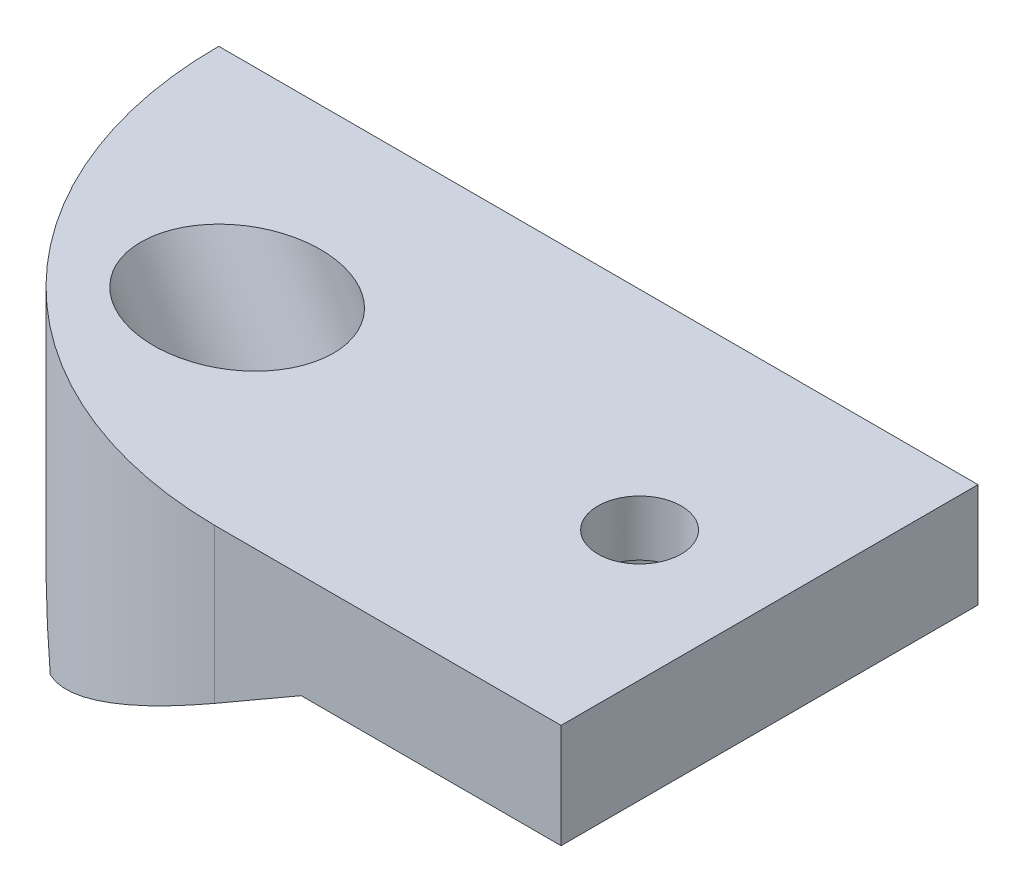
ISO-10303-21;
HEADER;
FILE_DESCRIPTION(('STEP AP214'),'2;1');
FILE_NAME('part.step','',(''),(''),'','','');
FILE_SCHEMA(('AUTOMOTIVE_DESIGN { 1 0 10303 214 1 1 1 1 }'));
ENDSEC;
DATA;
#1=APPLICATION_CONTEXT('core data for automotive mechanical design processes');
#2=APPLICATION_PROTOCOL_DEFINITION('international standard','automotive_design',2000,#1);
#3=PRODUCT_CONTEXT('',#1,'mechanical');
#4=PRODUCT('Part','Part','',(#3));
#5=PRODUCT_RELATED_PRODUCT_CATEGORY('part','',(#4));
#6=PRODUCT_DEFINITION_FORMATION('','',#4);
#7=PRODUCT_DEFINITION_CONTEXT('part definition',#1,'design');
#8=PRODUCT_DEFINITION('design','',#6,#7);
#9=PRODUCT_DEFINITION_SHAPE('','',#8);
#10=(LENGTH_UNIT() NAMED_UNIT(*) SI_UNIT(.MILLI.,.METRE.));
#11=(NAMED_UNIT(*) PLANE_ANGLE_UNIT() SI_UNIT($,.RADIAN.));
#12=(NAMED_UNIT(*) SI_UNIT($,.STERADIAN.) SOLID_ANGLE_UNIT());
#13=UNCERTAINTY_MEASURE_WITH_UNIT(LENGTH_MEASURE(1.E-05),#10,'distance_accuracy_value','');
#14=(GEOMETRIC_REPRESENTATION_CONTEXT(3) GLOBAL_UNCERTAINTY_ASSIGNED_CONTEXT((#13)) GLOBAL_UNIT_ASSIGNED_CONTEXT((#10,
#11,#12)) REPRESENTATION_CONTEXT('',''));
#15=CARTESIAN_POINT('',(0.,0.,0.));
#16=DIRECTION('',(0.,0.,1.));
#17=DIRECTION('',(1.,0.,0.));
#18=AXIS2_PLACEMENT_3D('',#15,#16,#17);
#19=CARTESIAN_POINT('',(-15.,22.775,-15.));
#20=DIRECTION('',(0.,0.,1.));
#21=DIRECTION('',(1.,0.,0.));
#22=AXIS2_PLACEMENT_3D('',#19,#20,#21);
#23=PLANE('',#22);
#24=DIRECTION('',(0.500000000000002,-0.866025403784438,0.));
#25=VECTOR('',#24,1.);
#26=CARTESIAN_POINT('',(-22.8522453423619,18.2415040378444,-15.));
#27=LINE('',#26,#25);
#28=CARTESIAN_POINT('',(-24.4749995728809,21.0521968133005,-15.));
#29=VERTEX_POINT('',#28);
#30=CARTESIAN_POINT('',(-12.9903810567666,1.16025403784439,-15.));
#31=VERTEX_POINT('',#30);
#32=EDGE_CURVE('E117',#29,#31,#27,.T.);
#33=ORIENTED_EDGE('',*,*,#32,.F.);
#34=DIRECTION('',(0.,1.,0.));
#35=VECTOR('',#34,1.);
#36=CARTESIAN_POINT('',(-24.4749995728809,-3.225,-15.));
#37=LINE('',#36,#35);
#38=CARTESIAN_POINT('',(-24.4749995728809,22.775,-15.));
#39=VERTEX_POINT('',#38);
#40=EDGE_CURVE('E57',#29,#39,#37,.T.);
#41=ORIENTED_EDGE('',*,*,#40,.T.);
#42=DIRECTION('',(-1.,0.,0.));
#43=VECTOR('',#42,1.);
#44=CARTESIAN_POINT('',(-15.,22.775,-15.));
#45=LINE('',#44,#43);
#46=CARTESIAN_POINT('',(30.1570760856145,22.775,-15.));
#47=VERTEX_POINT('',#46);
#48=EDGE_CURVE('E114',#47,#39,#45,.T.);
#49=ORIENTED_EDGE('',*,*,#48,.F.);
#50=DIRECTION('',(0.,-1.,0.));
#51=VECTOR('',#50,1.);
#52=CARTESIAN_POINT('',(30.1570760856145,22.775,-15.));
#53=LINE('',#52,#51);
#54=CARTESIAN_POINT('',(30.1570760856145,15.275,-15.));
#55=VERTEX_POINT('',#54);
#56=EDGE_CURVE('E155',#47,#55,#53,.T.);
#57=ORIENTED_EDGE('',*,*,#56,.T.);
#58=DIRECTION('',(-1.,0.,0.));
#59=VECTOR('',#58,1.);
#60=CARTESIAN_POINT('',(30.1570760856145,15.275,-15.));
#61=LINE('',#60,#59);
#62=CARTESIAN_POINT('',(11.4570760856145,15.275,-15.));
#63=VERTEX_POINT('',#62);
#64=EDGE_CURVE('E153',#55,#63,#61,.T.);
#65=ORIENTED_EDGE('',*,*,#64,.T.);
#66=DIRECTION('',(-0.866025403784438,-0.500000000000001,0.));
#67=VECTOR('',#66,1.);
#68=CARTESIAN_POINT('',(-15.,0.,-15.));
#69=LINE('',#68,#67);
#70=EDGE_CURVE('E124',#63,#31,#69,.T.);
#71=ORIENTED_EDGE('',*,*,#70,.T.);
#72=EDGE_LOOP('',(#33,#41,#49,#57,#65,#71));
#73=FACE_BOUND('',#72,.T.);
#74=ADVANCED_FACE('F42',(#73),#23,.F.);
#75=CARTESIAN_POINT('',(-15.,22.775,15.));
#76=DIRECTION('',(0.,0.,-1.));
#77=DIRECTION('',(-1.,0.,0.));
#78=AXIS2_PLACEMENT_3D('',#75,#76,#77);
#79=PLANE('',#78);
#80=DIRECTION('',(1.,0.,0.));
#81=VECTOR('',#80,1.);
#82=CARTESIAN_POINT('',(-15.,22.775,15.));
#83=LINE('',#82,#81);
#84=CARTESIAN_POINT('',(5.22196844924383,22.775,15.));
#85=VERTEX_POINT('',#84);
#86=CARTESIAN_POINT('',(30.1570760856145,22.775,15.));
#87=VERTEX_POINT('',#86);
#88=EDGE_CURVE('E123',#85,#87,#83,.T.);
#89=ORIENTED_EDGE('',*,*,#88,.F.);
#90=DIRECTION('',(0.,-1.,0.));
#91=VECTOR('',#90,1.);
#92=CARTESIAN_POINT('',(5.22196844924383,22.775,15.));
#93=LINE('',#92,#91);
#94=CARTESIAN_POINT('',(5.22196844924383,11.6751589277151,15.));
#95=VERTEX_POINT('',#94);
#96=EDGE_CURVE('E143',#85,#95,#93,.T.);
#97=ORIENTED_EDGE('',*,*,#96,.T.);
#98=DIRECTION('',(-0.866025403784438,-0.500000000000001,0.));
#99=VECTOR('',#98,1.);
#100=CARTESIAN_POINT('',(-15.,0.,15.));
#101=LINE('',#100,#99);
#102=CARTESIAN_POINT('',(11.4570760856145,15.275,15.));
#103=VERTEX_POINT('',#102);
#104=EDGE_CURVE('E127',#103,#95,#101,.T.);
#105=ORIENTED_EDGE('',*,*,#104,.F.);
#106=DIRECTION('',(1.,0.,0.));
#107=VECTOR('',#106,1.);
#108=CARTESIAN_POINT('',(30.1570760856145,15.275,15.));
#109=LINE('',#108,#107);
#110=CARTESIAN_POINT('',(30.1570760856145,15.275,15.));
#111=VERTEX_POINT('',#110);
#112=EDGE_CURVE('E165',#103,#111,#109,.T.);
#113=ORIENTED_EDGE('',*,*,#112,.T.);
#114=DIRECTION('',(0.,1.,0.));
#115=VECTOR('',#114,1.);
#116=CARTESIAN_POINT('',(30.1570760856145,22.775,15.));
#117=LINE('',#116,#115);
#118=EDGE_CURVE('E160',#111,#87,#117,.T.);
#119=ORIENTED_EDGE('',*,*,#118,.T.);
#120=EDGE_LOOP('',(#89,#97,#105,#113,#119));
#121=FACE_BOUND('',#120,.T.);
#122=ADVANCED_FACE('F198',(#121),#79,.F.);
#123=CARTESIAN_POINT('',(0.,22.775,0.));
#124=DIRECTION('',(0.,-1.,0.));
#125=DIRECTION('',(0.,0.,-1.));
#126=AXIS2_PLACEMENT_3D('',#123,#124,#125);
#127=PLANE('',#126);
#128=CARTESIAN_POINT('',(20.8070760856145,22.775,0.));
#129=DIRECTION('',(0.,-1.,0.));
#130=DIRECTION('',(0.,0.,-1.));
#131=AXIS2_PLACEMENT_3D('',#128,#129,#130);
#132=CIRCLE('',#131,2.99999999999999);
#133=CARTESIAN_POINT('',(20.8070760856145,22.775,-2.99999999999999));
#134=VERTEX_POINT('',#133);
#135=EDGE_CURVE('E45',#134,#134,#132,.T.);
#136=ORIENTED_EDGE('',*,*,#135,.T.);
#137=EDGE_LOOP('',(#136));
#138=FACE_BOUND('',#137,.T.);
#139=CARTESIAN_POINT('',(-8.14914767260905,22.775,4.07721530149008E-06));
#140=DIRECTION('',(0.,-1.,0.));
#141=DIRECTION('',(1.,0.,0.));
#142=AXIS2_PLACEMENT_3D('',#139,#140,#141);
#143=ELLIPSE('',#142,6.92820323027552,6.);
#144=CARTESIAN_POINT('',(-1.22094444233353,22.775,4.07721530149008E-06));
#145=VERTEX_POINT('',#144);
#146=EDGE_CURVE('E134',#145,#145,#143,.T.);
#147=ORIENTED_EDGE('',*,*,#146,.T.);
#148=EDGE_LOOP('',(#147));
#149=FACE_BOUND('',#148,.T.);
#150=ORIENTED_EDGE('',*,*,#48,.T.);
#151=CARTESIAN_POINT('',(5.52500042711731,22.775,-15.0000095703205));
#152=DIRECTION('',(0.,-1.,0.));
#153=DIRECTION('',(0.,0.,1.));
#154=AXIS2_PLACEMENT_3D('',#151,#152,#153);
#155=CIRCLE('',#154,29.9999999999999);
#156=CARTESIAN_POINT('',(5.22196844924383,22.775,14.9984599176448));
#157=VERTEX_POINT('',#156);
#158=EDGE_CURVE('E101',#157,#39,#155,.T.);
#159=ORIENTED_EDGE('',*,*,#158,.F.);
#160=DIRECTION('',(0.,0.,-1.));
#161=VECTOR('',#160,1.);
#162=CARTESIAN_POINT('',(5.22196844924383,22.775,14.9984599176448));
#163=LINE('',#162,#161);
#164=EDGE_CURVE('E109',#85,#157,#163,.T.);
#165=ORIENTED_EDGE('',*,*,#164,.F.);
#166=ORIENTED_EDGE('',*,*,#88,.T.);
#167=DIRECTION('',(0.,0.,1.));
#168=VECTOR('',#167,1.);
#169=CARTESIAN_POINT('',(30.1570760856145,22.775,-37.2856559319545));
#170=LINE('',#169,#168);
#171=EDGE_CURVE('E122',#47,#87,#170,.T.);
#172=ORIENTED_EDGE('',*,*,#171,.F.);
#173=EDGE_LOOP('',(#150,#159,#165,#166,#172));
#174=FACE_BOUND('',#173,.T.);
#175=ADVANCED_FACE('F120',(#138,#149,#174),#127,.F.);
#176=CARTESIAN_POINT('',(-15.,0.,-15.));
#177=DIRECTION('',(-0.500000000000001,0.866025403784438,0.));
#178=DIRECTION('',(-0.866025403784438,-0.500000000000001,0.));
#179=AXIS2_PLACEMENT_3D('',#176,#177,#178);
#180=PLANE('',#179);
#181=CARTESIAN_POINT('',(3.53113851526976E-06,8.66025607654819,4.07721530149008E-06));
#182=DIRECTION('',(0.500000000000001,-0.866025403784438,0.));
#183=DIRECTION('',(0.866025403784438,0.500000000000001,0.));
#184=AXIS2_PLACEMENT_3D('',#181,#182,#183);
#185=CIRCLE('',#184,3.95);
#186=CARTESIAN_POINT('',(3.42080387608705,10.6352560765482,4.07721530149008E-06));
#187=VERTEX_POINT('',#186);
#188=EDGE_CURVE('E138',#187,#187,#185,.T.);
#189=ORIENTED_EDGE('',*,*,#188,.F.);
#190=EDGE_LOOP('',(#189));
#191=FACE_BOUND('',#190,.T.);
#192=DIRECTION('',(0.,0.,-1.));
#193=VECTOR('',#192,1.);
#194=CARTESIAN_POINT('',(5.22196844924349,11.6751589277149,-15.0000000000003));
#195=LINE('',#194,#193);
#196=CARTESIAN_POINT('',(5.22196844924383,11.6751589277151,14.9984599176448));
#197=VERTEX_POINT('',#196);
#198=EDGE_CURVE('E12',#95,#197,#195,.T.);
#199=ORIENTED_EDGE('',*,*,#198,.T.);
#200=CARTESIAN_POINT('',(5.52500042711731,11.8501145217134,-15.0000095703205));
#201=DIRECTION('',(-0.500000000000001,0.866025403784438,0.));
#202=DIRECTION('',(0.866025403784438,0.500000000000001,0.));
#203=AXIS2_PLACEMENT_3D('',#200,#201,#202);
#204=ELLIPSE('',#203,34.6410161513774,29.9999999999999);
#205=CARTESIAN_POINT('',(-12.9903810567666,1.16025403784439,8.60466472326467));
#206=VERTEX_POINT('',#205);
#207=EDGE_CURVE('E139',#197,#206,#204,.F.);
#208=ORIENTED_EDGE('',*,*,#207,.T.);
#209=DIRECTION('',(0.,0.,-1.));
#210=VECTOR('',#209,1.);
#211=CARTESIAN_POINT('',(-12.9903810567666,1.16025403784439,15.));
#212=LINE('',#211,#210);
#213=EDGE_CURVE('E65',#206,#31,#212,.T.);
#214=ORIENTED_EDGE('',*,*,#213,.T.);
#215=ORIENTED_EDGE('',*,*,#70,.F.);
#216=DIRECTION('',(0.,0.,1.));
#217=VECTOR('',#216,1.);
#218=CARTESIAN_POINT('',(11.4570760856145,15.275,-37.2856559319545));
#219=LINE('',#218,#217);
#220=EDGE_CURVE('E156',#63,#103,#219,.T.);
#221=ORIENTED_EDGE('',*,*,#220,.T.);
#222=ORIENTED_EDGE('',*,*,#104,.T.);
#223=EDGE_LOOP('',(#199,#208,#214,#215,#221,#222));
#224=FACE_BOUND('',#223,.T.);
#225=ADVANCED_FACE('F141',(#191,#224),#180,.F.);
#226=CARTESIAN_POINT('',(-22.8522453423619,18.2415040378444,15.));
#227=DIRECTION('',(-0.866025403784438,-0.500000000000002,0.));
#228=DIRECTION('',(0.500000000000002,-0.866025403784438,0.));
#229=AXIS2_PLACEMENT_3D('',#226,#227,#228);
#230=PLANE('',#229);
#231=CARTESIAN_POINT('',(5.52500042711731,-30.9093274137624,-15.0000095703205));
#232=DIRECTION('',(-0.866025403784438,-0.500000000000002,0.));
#233=DIRECTION('',(-0.500000000000002,0.866025403784438,0.));
#234=AXIS2_PLACEMENT_3D('',#231,#232,#233);
#235=ELLIPSE('',#234,59.9999999999995,29.9999999999999);
#236=EDGE_CURVE('E50',#29,#206,#235,.F.);
#237=ORIENTED_EDGE('',*,*,#236,.F.);
#238=ORIENTED_EDGE('',*,*,#32,.T.);
#239=ORIENTED_EDGE('',*,*,#213,.F.);
#240=EDGE_LOOP('',(#237,#238,#239));
#241=FACE_BOUND('',#240,.T.);
#242=ADVANCED_FACE('F145',(#241),#230,.T.);
#243=CARTESIAN_POINT('',(-12.4792758685774,30.2750020387038,4.07721530149008E-06));
#244=DIRECTION('',(0.500000000000001,-0.866025403784438,0.));
#245=DIRECTION('',(0.866025403784438,0.500000000000001,0.));
#246=AXIS2_PLACEMENT_3D('',#243,#244,#245);
#247=CYLINDRICAL_SURFACE('',#246,3.95);
#248=CARTESIAN_POINT('',(-3.9999964688615,15.5884593068237,4.07721530149008E-06));
#249=DIRECTION('',(0.500000000000001,-0.866025403784438,0.));
#250=DIRECTION('',(0.866025403784438,0.500000000000001,0.));
#251=AXIS2_PLACEMENT_3D('',#248,#249,#250);
#252=CIRCLE('',#251,3.95);
#253=CARTESIAN_POINT('',(-0.579196123912965,17.5634593068237,4.07721530149008E-06));
#254=VERTEX_POINT('',#253);
#255=EDGE_CURVE('E131',#254,#254,#252,.F.);
#256=ORIENTED_EDGE('',*,*,#255,.T.);
#257=EDGE_LOOP('',(#256));
#258=FACE_BOUND('',#257,.T.);
#259=ORIENTED_EDGE('',*,*,#188,.T.);
#260=EDGE_LOOP('',(#259));
#261=FACE_BOUND('',#260,.T.);
#262=ADVANCED_FACE('F215',(#258,#261),#247,.F.);
#263=CARTESIAN_POINT('',(-16.4999964688615,37.2390944014346,4.07721530149008E-06));
#264=DIRECTION('',(0.500000000000001,-0.866025403784438,0.));
#265=DIRECTION('',(0.866025403784438,0.500000000000001,0.));
#266=AXIS2_PLACEMENT_3D('',#263,#264,#265);
#267=CYLINDRICAL_SURFACE('',#266,6.);
#268=CARTESIAN_POINT('',(-3.9999964688615,15.5884593068237,4.07721530149008E-06));
#269=DIRECTION('',(0.500000000000001,-0.866025403784438,0.));
#270=DIRECTION('',(0.866025403784438,0.500000000000001,0.));
#271=AXIS2_PLACEMENT_3D('',#268,#269,#270);
#272=CIRCLE('',#271,6.);
#273=CARTESIAN_POINT('',(1.19615595384513,18.5884593068237,4.07721530149008E-06));
#274=VERTEX_POINT('',#273);
#275=EDGE_CURVE('E135',#274,#274,#272,.T.);
#276=ORIENTED_EDGE('',*,*,#275,.T.);
#277=EDGE_LOOP('',(#276));
#278=FACE_BOUND('',#277,.T.);
#279=ORIENTED_EDGE('',*,*,#146,.F.);
#280=EDGE_LOOP('',(#279));
#281=FACE_BOUND('',#280,.T.);
#282=ADVANCED_FACE('F218',(#278,#281),#267,.F.);
#283=CARTESIAN_POINT('',(-3.9999964688615,15.5884593068237,4.07721530149008E-06));
#284=DIRECTION('',(0.500000000000001,-0.866025403784438,0.));
#285=DIRECTION('',(0.866025403784438,0.500000000000001,0.));
#286=AXIS2_PLACEMENT_3D('',#283,#284,#285);
#287=PLANE('',#286);
#288=ORIENTED_EDGE('',*,*,#275,.F.);
#289=EDGE_LOOP('',(#288));
#290=FACE_BOUND('',#289,.T.);
#291=ORIENTED_EDGE('',*,*,#255,.F.);
#292=EDGE_LOOP('',(#291));
#293=FACE_BOUND('',#292,.T.);
#294=ADVANCED_FACE('F222',(#290,#293),#287,.F.);
#295=CARTESIAN_POINT('',(30.1570760856145,22.775,-37.2856559319545));
#296=DIRECTION('',(1.,0.,0.));
#297=DIRECTION('',(0.,0.,-1.));
#298=AXIS2_PLACEMENT_3D('',#295,#296,#297);
#299=PLANE('',#298);
#300=ORIENTED_EDGE('',*,*,#56,.F.);
#301=ORIENTED_EDGE('',*,*,#171,.T.);
#302=ORIENTED_EDGE('',*,*,#118,.F.);
#303=DIRECTION('',(0.,0.,1.));
#304=VECTOR('',#303,1.);
#305=CARTESIAN_POINT('',(30.1570760856145,15.275,-37.2856559319545));
#306=LINE('',#305,#304);
#307=EDGE_CURVE('E159',#55,#111,#306,.T.);
#308=ORIENTED_EDGE('',*,*,#307,.F.);
#309=EDGE_LOOP('',(#300,#301,#302,#308));
#310=FACE_BOUND('',#309,.T.);
#311=ADVANCED_FACE('F226',(#310),#299,.T.);
#312=CARTESIAN_POINT('',(30.1570760856145,15.275,-37.2856559319545));
#313=DIRECTION('',(0.,-1.,0.));
#314=DIRECTION('',(0.,0.,-1.));
#315=AXIS2_PLACEMENT_3D('',#312,#313,#314);
#316=PLANE('',#315);
#317=CARTESIAN_POINT('',(20.8070760856145,15.275,0.));
#318=DIRECTION('',(0.,-1.,0.));
#319=DIRECTION('',(1.,0.,0.));
#320=AXIS2_PLACEMENT_3D('',#317,#318,#319);
#321=CIRCLE('',#320,6.35);
#322=CARTESIAN_POINT('',(27.1570760856145,15.275,0.));
#323=VERTEX_POINT('',#322);
#324=EDGE_CURVE('E173',#323,#323,#321,.T.);
#325=ORIENTED_EDGE('',*,*,#324,.F.);
#326=EDGE_LOOP('',(#325));
#327=FACE_BOUND('',#326,.T.);
#328=ORIENTED_EDGE('',*,*,#64,.F.);
#329=ORIENTED_EDGE('',*,*,#307,.T.);
#330=ORIENTED_EDGE('',*,*,#112,.F.);
#331=ORIENTED_EDGE('',*,*,#220,.F.);
#332=EDGE_LOOP('',(#328,#329,#330,#331));
#333=FACE_BOUND('',#332,.T.);
#334=ADVANCED_FACE('F228',(#327,#333),#316,.T.);
#335=CARTESIAN_POINT('',(5.22196844924383,-3.225,14.9984599176448));
#336=DIRECTION('',(1.,0.,0.));
#337=DIRECTION('',(0.,0.,-1.));
#338=AXIS2_PLACEMENT_3D('',#335,#336,#337);
#339=PLANE('',#338);
#340=ORIENTED_EDGE('',*,*,#164,.T.);
#341=DIRECTION('',(0.,1.,0.));
#342=VECTOR('',#341,1.);
#343=CARTESIAN_POINT('',(5.22196844924383,-3.225,14.9984599176448));
#344=LINE('',#343,#342);
#345=EDGE_CURVE('E104',#197,#157,#344,.T.);
#346=ORIENTED_EDGE('',*,*,#345,.F.);
#347=ORIENTED_EDGE('',*,*,#198,.F.);
#348=ORIENTED_EDGE('',*,*,#96,.F.);
#349=EDGE_LOOP('',(#340,#346,#347,#348));
#350=FACE_BOUND('',#349,.T.);
#351=ADVANCED_FACE('F231',(#350),#339,.F.);
#352=CARTESIAN_POINT('',(5.52500042711731,-3.225,-15.0000095703205));
#353=DIRECTION('',(0.,1.,0.));
#354=DIRECTION('',(0.,0.,1.));
#355=AXIS2_PLACEMENT_3D('',#352,#353,#354);
#356=CYLINDRICAL_SURFACE('',#355,29.9999999999999);
#357=ORIENTED_EDGE('',*,*,#345,.T.);
#358=ORIENTED_EDGE('',*,*,#158,.T.);
#359=ORIENTED_EDGE('',*,*,#40,.F.);
#360=ORIENTED_EDGE('',*,*,#236,.T.);
#361=ORIENTED_EDGE('',*,*,#207,.F.);
#362=EDGE_LOOP('',(#357,#358,#359,#360,#361));
#363=FACE_BOUND('',#362,.T.);
#364=ADVANCED_FACE('F102',(#363),#356,.T.);
#365=CARTESIAN_POINT('',(20.8070760856145,18.775,0.));
#366=DIRECTION('',(0.,-1.,0.));
#367=DIRECTION('',(1.,0.,0.));
#368=AXIS2_PLACEMENT_3D('',#365,#366,#367);
#369=CYLINDRICAL_SURFACE('',#368,6.35);
#370=CARTESIAN_POINT('',(20.8070760856145,18.775,0.));
#371=DIRECTION('',(0.,-1.,0.));
#372=DIRECTION('',(1.,0.,0.));
#373=AXIS2_PLACEMENT_3D('',#370,#371,#372);
#374=CIRCLE('',#373,6.35);
#375=CARTESIAN_POINT('',(27.1570760856145,18.775,0.));
#376=VERTEX_POINT('',#375);
#377=EDGE_CURVE('E110',#376,#376,#374,.T.);
#378=ORIENTED_EDGE('',*,*,#377,.F.);
#379=EDGE_LOOP('',(#378));
#380=FACE_BOUND('',#379,.T.);
#381=ORIENTED_EDGE('',*,*,#324,.T.);
#382=EDGE_LOOP('',(#381));
#383=FACE_BOUND('',#382,.T.);
#384=ADVANCED_FACE('F194',(#380,#383),#369,.F.);
#385=CARTESIAN_POINT('',(20.8070760856145,18.775,0.));
#386=DIRECTION('',(0.,-1.,0.));
#387=DIRECTION('',(1.,0.,0.));
#388=AXIS2_PLACEMENT_3D('',#385,#386,#387);
#389=PLANE('',#388);
#390=CARTESIAN_POINT('',(20.8070760856145,18.775,0.));
#391=DIRECTION('',(0.,-1.,0.));
#392=DIRECTION('',(1.,0.,0.));
#393=AXIS2_PLACEMENT_3D('',#390,#391,#392);
#394=CIRCLE('',#393,2.99999999999999);
#395=CARTESIAN_POINT('',(23.8070760856145,18.775,0.));
#396=VERTEX_POINT('',#395);
#397=EDGE_CURVE('E178',#396,#396,#394,.T.);
#398=ORIENTED_EDGE('',*,*,#397,.F.);
#399=EDGE_LOOP('',(#398));
#400=FACE_BOUND('',#399,.T.);
#401=ORIENTED_EDGE('',*,*,#377,.T.);
#402=EDGE_LOOP('',(#401));
#403=FACE_BOUND('',#402,.T.);
#404=ADVANCED_FACE('F189',(#400,#403),#389,.T.);
#405=CARTESIAN_POINT('',(20.8070760856145,44.775,0.));
#406=DIRECTION('',(0.,-1.,0.));
#407=DIRECTION('',(1.,0.,0.));
#408=AXIS2_PLACEMENT_3D('',#405,#406,#407);
#409=CYLINDRICAL_SURFACE('',#408,2.99999999999999);
#410=ORIENTED_EDGE('',*,*,#397,.T.);
#411=EDGE_LOOP('',(#410));
#412=FACE_BOUND('',#411,.T.);
#413=ORIENTED_EDGE('',*,*,#135,.F.);
#414=EDGE_LOOP('',(#413));
#415=FACE_BOUND('',#414,.T.);
#416=ADVANCED_FACE('F187',(#412,#415),#409,.F.);
#417=CLOSED_SHELL('',(#74,#122,#175,#225,#242,#262,#282,#294,#311,#334,#351,#364,#384,#404,#416));
#418=MANIFOLD_SOLID_BREP('B2',#417);
#419=ADVANCED_BREP_SHAPE_REPRESENTATION('',(#18,#418),#14);
#420=SHAPE_DEFINITION_REPRESENTATION(#9,#419);
ENDSEC;
END-ISO-10303-21;
